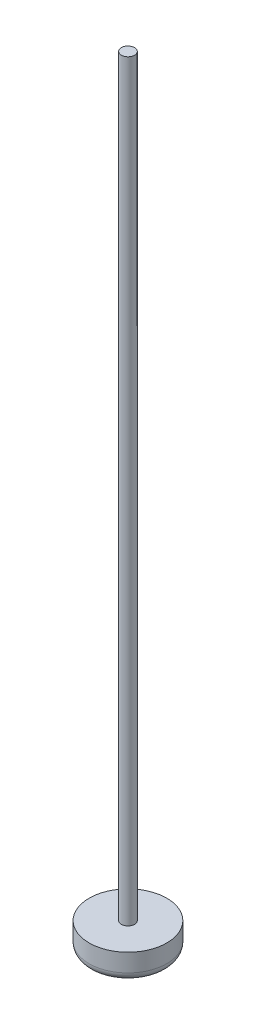
ISO-10303-21;
HEADER;
FILE_DESCRIPTION(('STEP AP214'),'2;1');
FILE_NAME('part.step','',(''),(''),'','','');
FILE_SCHEMA(('AUTOMOTIVE_DESIGN { 1 0 10303 214 1 1 1 1 }'));
ENDSEC;
DATA;
#1=APPLICATION_CONTEXT('core data for automotive mechanical design processes');
#2=APPLICATION_PROTOCOL_DEFINITION('international standard','automotive_design',2000,#1);
#3=PRODUCT_CONTEXT('',#1,'mechanical');
#4=PRODUCT('Part','Part','',(#3));
#5=PRODUCT_RELATED_PRODUCT_CATEGORY('part','',(#4));
#6=PRODUCT_DEFINITION_FORMATION('','',#4);
#7=PRODUCT_DEFINITION_CONTEXT('part definition',#1,'design');
#8=PRODUCT_DEFINITION('design','',#6,#7);
#9=PRODUCT_DEFINITION_SHAPE('','',#8);
#10=(LENGTH_UNIT() NAMED_UNIT(*) SI_UNIT(.MILLI.,.METRE.));
#11=(NAMED_UNIT(*) PLANE_ANGLE_UNIT() SI_UNIT($,.RADIAN.));
#12=(NAMED_UNIT(*) SI_UNIT($,.STERADIAN.) SOLID_ANGLE_UNIT());
#13=UNCERTAINTY_MEASURE_WITH_UNIT(LENGTH_MEASURE(1.E-05),#10,'distance_accuracy_value','');
#14=(GEOMETRIC_REPRESENTATION_CONTEXT(3) GLOBAL_UNCERTAINTY_ASSIGNED_CONTEXT((#13)) GLOBAL_UNIT_ASSIGNED_CONTEXT((#10,
#11,#12)) REPRESENTATION_CONTEXT('',''));
#15=CARTESIAN_POINT('',(0.,0.,0.));
#16=DIRECTION('',(0.,0.,1.));
#17=DIRECTION('',(1.,0.,0.));
#18=AXIS2_PLACEMENT_3D('',#15,#16,#17);
#19=CARTESIAN_POINT('',(0.,3.175,0.));
#20=DIRECTION('',(0.,-1.,0.));
#21=DIRECTION('',(0.,0.,-1.));
#22=AXIS2_PLACEMENT_3D('',#19,#20,#21);
#23=CYLINDRICAL_SURFACE('',#22,4.66725);
#24=CARTESIAN_POINT('',(0.,1.016,0.));
#25=DIRECTION('',(0.,1.,0.));
#26=DIRECTION('',(0.,0.,1.));
#27=AXIS2_PLACEMENT_3D('',#24,#25,#26);
#28=CIRCLE('',#27,4.66725);
#29=CARTESIAN_POINT('',(0.,1.016,4.66725));
#30=VERTEX_POINT('',#29);
#31=EDGE_CURVE('E42',#30,#30,#28,.T.);
#32=ORIENTED_EDGE('',*,*,#31,.T.);
#33=EDGE_LOOP('',(#32));
#34=FACE_BOUND('',#33,.T.);
#35=CARTESIAN_POINT('',(0.,3.175,0.));
#36=DIRECTION('',(0.,1.,0.));
#37=DIRECTION('',(0.,0.,1.));
#38=AXIS2_PLACEMENT_3D('',#35,#36,#37);
#39=CIRCLE('',#38,4.66725);
#40=CARTESIAN_POINT('',(0.,3.175,4.66725));
#41=VERTEX_POINT('',#40);
#42=EDGE_CURVE('E50',#41,#41,#39,.T.);
#43=ORIENTED_EDGE('',*,*,#42,.F.);
#44=EDGE_LOOP('',(#43));
#45=FACE_BOUND('',#44,.T.);
#46=ADVANCED_FACE('F35',(#34,#45),#23,.T.);
#47=CARTESIAN_POINT('',(0.,3.175,0.));
#48=DIRECTION('',(0.,1.,0.));
#49=DIRECTION('',(0.,0.,1.));
#50=AXIS2_PLACEMENT_3D('',#47,#48,#49);
#51=PLANE('',#50);
#52=CARTESIAN_POINT('',(0.,3.175,0.));
#53=DIRECTION('',(0.,1.,0.));
#54=DIRECTION('',(0.,0.,1.));
#55=AXIS2_PLACEMENT_3D('',#52,#53,#54);
#56=CIRCLE('',#55,0.79375);
#57=CARTESIAN_POINT('',(0.,3.175,0.79375));
#58=VERTEX_POINT('',#57);
#59=EDGE_CURVE('E46',#58,#58,#56,.T.);
#60=ORIENTED_EDGE('',*,*,#59,.F.);
#61=EDGE_LOOP('',(#60));
#62=FACE_BOUND('',#61,.T.);
#63=ORIENTED_EDGE('',*,*,#42,.T.);
#64=EDGE_LOOP('',(#63));
#65=FACE_BOUND('',#64,.T.);
#66=ADVANCED_FACE('F68',(#62,#65),#51,.T.);
#67=CARTESIAN_POINT('',(0.,0.,0.));
#68=DIRECTION('',(0.,1.,0.));
#69=DIRECTION('',(0.,0.,1.));
#70=AXIS2_PLACEMENT_3D('',#67,#68,#69);
#71=PLANE('',#70);
#72=CARTESIAN_POINT('',(0.,0.,0.));
#73=DIRECTION('',(0.,1.,0.));
#74=DIRECTION('',(0.,0.,1.));
#75=AXIS2_PLACEMENT_3D('',#72,#73,#74);
#76=CIRCLE('',#75,3.65125);
#77=CARTESIAN_POINT('',(0.,0.,3.65125));
#78=VERTEX_POINT('',#77);
#79=EDGE_CURVE('E10',#78,#78,#76,.F.);
#80=ORIENTED_EDGE('',*,*,#79,.T.);
#81=EDGE_LOOP('',(#80));
#82=FACE_BOUND('',#81,.T.);
#83=ADVANCED_FACE('F64',(#82),#71,.F.);
#84=CARTESIAN_POINT('',(0.,93.6625,0.));
#85=DIRECTION('',(0.,-1.,0.));
#86=DIRECTION('',(0.,0.,-1.));
#87=AXIS2_PLACEMENT_3D('',#84,#85,#86);
#88=CYLINDRICAL_SURFACE('',#87,0.79375);
#89=CARTESIAN_POINT('',(0.,93.6625,0.));
#90=DIRECTION('',(0.,1.,0.));
#91=DIRECTION('',(0.,0.,1.));
#92=AXIS2_PLACEMENT_3D('',#89,#90,#91);
#93=CIRCLE('',#92,0.79375);
#94=CARTESIAN_POINT('',(0.,93.6625,0.79375));
#95=VERTEX_POINT('',#94);
#96=EDGE_CURVE('E54',#95,#95,#93,.T.);
#97=ORIENTED_EDGE('',*,*,#96,.F.);
#98=EDGE_LOOP('',(#97));
#99=FACE_BOUND('',#98,.T.);
#100=ORIENTED_EDGE('',*,*,#59,.T.);
#101=EDGE_LOOP('',(#100));
#102=FACE_BOUND('',#101,.T.);
#103=ADVANCED_FACE('F61',(#99,#102),#88,.T.);
#104=CARTESIAN_POINT('',(0.,93.6625,0.));
#105=DIRECTION('',(0.,1.,0.));
#106=DIRECTION('',(0.,0.,1.));
#107=AXIS2_PLACEMENT_3D('',#104,#105,#106);
#108=PLANE('',#107);
#109=ORIENTED_EDGE('',*,*,#96,.T.);
#110=EDGE_LOOP('',(#109));
#111=FACE_BOUND('',#110,.T.);
#112=ADVANCED_FACE('F59',(#111),#108,.T.);
#113=CARTESIAN_POINT('',(0.,1.016,0.));
#114=DIRECTION('',(0.,1.,0.));
#115=DIRECTION('',(0.,0.,1.));
#116=AXIS2_PLACEMENT_3D('',#113,#114,#115);
#117=TOROIDAL_SURFACE('',#116,3.65125,1.016);
#118=ORIENTED_EDGE('',*,*,#79,.F.);
#119=EDGE_LOOP('',(#118));
#120=FACE_BOUND('',#119,.T.);
#121=ORIENTED_EDGE('',*,*,#31,.F.);
#122=EDGE_LOOP('',(#121));
#123=FACE_BOUND('',#122,.T.);
#124=ADVANCED_FACE('F37',(#120,#123),#117,.T.);
#125=CLOSED_SHELL('',(#46,#66,#83,#103,#112,#124));
#126=MANIFOLD_SOLID_BREP('B2',#125);
#127=ADVANCED_BREP_SHAPE_REPRESENTATION('',(#18,#126),#14);
#128=SHAPE_DEFINITION_REPRESENTATION(#9,#127);
ENDSEC;
END-ISO-10303-21;
